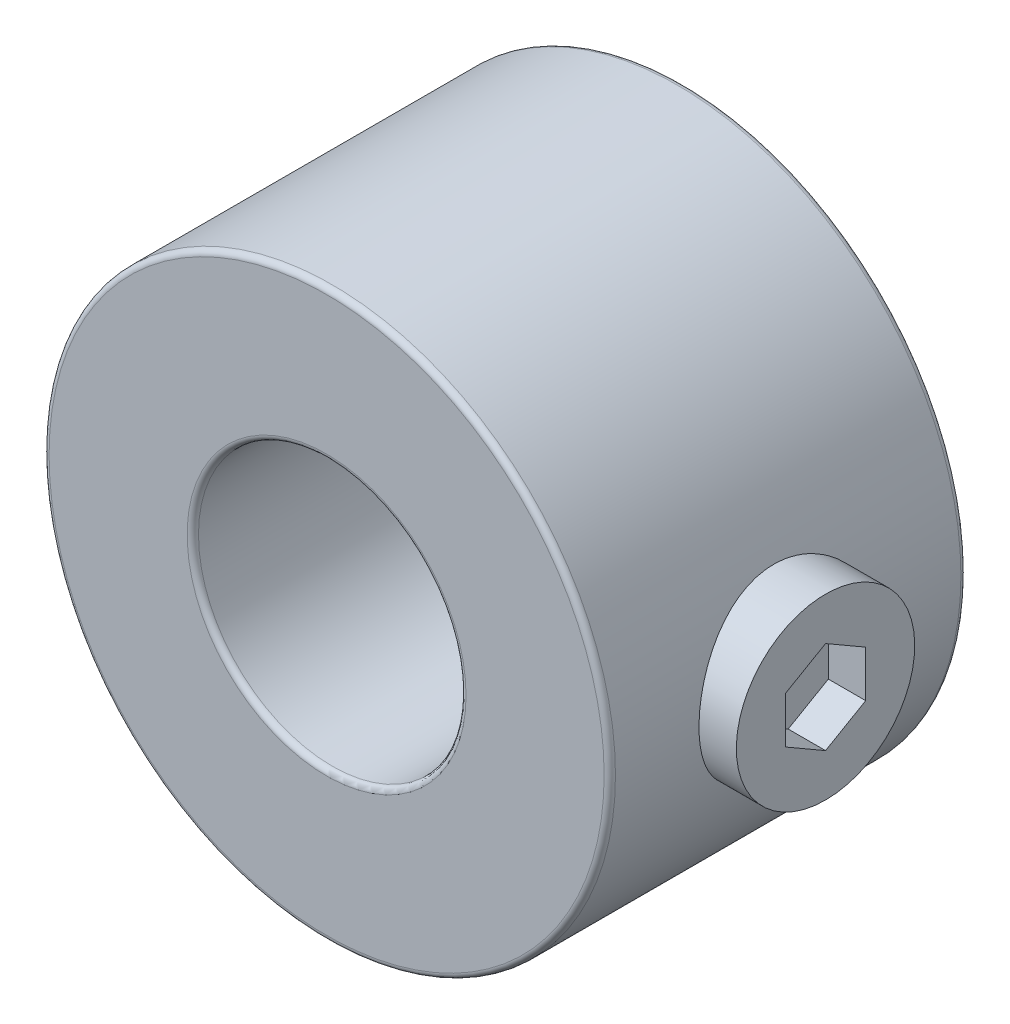
ISO-10303-21;
HEADER;
FILE_DESCRIPTION(('STEP AP214'),'2;1');
FILE_NAME('part.step','',(''),(''),'','','');
FILE_SCHEMA(('AUTOMOTIVE_DESIGN { 1 0 10303 214 1 1 1 1 }'));
ENDSEC;
DATA;
#1=APPLICATION_CONTEXT('core data for automotive mechanical design processes');
#2=APPLICATION_PROTOCOL_DEFINITION('international standard','automotive_design',2000,#1);
#3=PRODUCT_CONTEXT('',#1,'mechanical');
#4=PRODUCT('Part','Part','',(#3));
#5=PRODUCT_RELATED_PRODUCT_CATEGORY('part','',(#4));
#6=PRODUCT_DEFINITION_FORMATION('','',#4);
#7=PRODUCT_DEFINITION_CONTEXT('part definition',#1,'design');
#8=PRODUCT_DEFINITION('design','',#6,#7);
#9=PRODUCT_DEFINITION_SHAPE('','',#8);
#10=(LENGTH_UNIT() NAMED_UNIT(*) SI_UNIT(.MILLI.,.METRE.));
#11=(NAMED_UNIT(*) PLANE_ANGLE_UNIT() SI_UNIT($,.RADIAN.));
#12=(NAMED_UNIT(*) SI_UNIT($,.STERADIAN.) SOLID_ANGLE_UNIT());
#13=UNCERTAINTY_MEASURE_WITH_UNIT(LENGTH_MEASURE(1.E-05),#10,'distance_accuracy_value','');
#14=(GEOMETRIC_REPRESENTATION_CONTEXT(3) GLOBAL_UNCERTAINTY_ASSIGNED_CONTEXT((#13)) GLOBAL_UNIT_ASSIGNED_CONTEXT((#10,
#11,#12)) REPRESENTATION_CONTEXT('',''));
#15=CARTESIAN_POINT('',(0.,0.,0.));
#16=DIRECTION('',(0.,0.,1.));
#17=DIRECTION('',(1.,0.,0.));
#18=AXIS2_PLACEMENT_3D('',#15,#16,#17);
#19=CARTESIAN_POINT('',(3.8375,0.,4.));
#20=DIRECTION('',(1.,0.,0.));
#21=DIRECTION('',(0.,1.,0.));
#22=AXIS2_PLACEMENT_3D('',#19,#20,#21);
#23=PLANE('',#22);
#24=CARTESIAN_POINT('',(3.8375,0.,4.));
#25=DIRECTION('',(-1.,0.,0.));
#26=DIRECTION('',(0.,-1.,0.));
#27=AXIS2_PLACEMENT_3D('',#24,#25,#26);
#28=CIRCLE('',#27,2.);
#29=CARTESIAN_POINT('',(3.8375,-2.,4.));
#30=VERTEX_POINT('',#29);
#31=EDGE_CURVE('E12',#30,#30,#28,.T.);
#32=ORIENTED_EDGE('',*,*,#31,.T.);
#33=EDGE_LOOP('',(#32));
#34=FACE_BOUND('',#33,.T.);
#35=ADVANCED_FACE('F41',(#34),#23,.F.);
#36=CARTESIAN_POINT('',(3.8375,0.,4.));
#37=DIRECTION('',(-1.,0.,0.));
#38=DIRECTION('',(0.,-1.,0.));
#39=AXIS2_PLACEMENT_3D('',#36,#37,#38);
#40=CYLINDRICAL_SURFACE('',#39,2.);
#41=ORIENTED_EDGE('',*,*,#31,.F.);
#42=EDGE_LOOP('',(#41));
#43=FACE_BOUND('',#42,.T.);
#44=CARTESIAN_POINT('',(7.1875,0.,4.));
#45=DIRECTION('',(-1.,0.,0.));
#46=DIRECTION('',(0.,-1.,0.));
#47=AXIS2_PLACEMENT_3D('',#44,#45,#46);
#48=CIRCLE('',#47,2.);
#49=CARTESIAN_POINT('',(7.1875,-2.,4.));
#50=VERTEX_POINT('',#49);
#51=EDGE_CURVE('E48',#50,#50,#48,.T.);
#52=ORIENTED_EDGE('',*,*,#51,.T.);
#53=EDGE_LOOP('',(#52));
#54=FACE_BOUND('',#53,.T.);
#55=ADVANCED_FACE('F151',(#43,#54),#40,.T.);
#56=CARTESIAN_POINT('',(7.1875,0.,4.));
#57=DIRECTION('',(-1.,0.,0.));
#58=DIRECTION('',(0.,-1.,0.));
#59=AXIS2_PLACEMENT_3D('',#56,#57,#58);
#60=PLANE('',#59);
#61=DIRECTION('',(0.,-0.5,0.866025403784438));
#62=VECTOR('',#61,1.);
#63=CARTESIAN_POINT('',(7.1875,1.03923048454133,4.));
#64=LINE('',#63,#62);
#65=CARTESIAN_POINT('',(7.1875,1.03923048454133,4.));
#66=VERTEX_POINT('',#65);
#67=CARTESIAN_POINT('',(7.1875,0.51961524227067,4.9));
#68=VERTEX_POINT('',#67);
#69=EDGE_CURVE('E109',#66,#68,#64,.T.);
#70=ORIENTED_EDGE('',*,*,#69,.F.);
#71=DIRECTION('',(0.,0.5,0.866025403784439));
#72=VECTOR('',#71,1.);
#73=CARTESIAN_POINT('',(7.1875,0.519615242270671,3.1));
#74=LINE('',#73,#72);
#75=CARTESIAN_POINT('',(7.1875,0.519615242270671,3.1));
#76=VERTEX_POINT('',#75);
#77=EDGE_CURVE('E55',#76,#66,#74,.T.);
#78=ORIENTED_EDGE('',*,*,#77,.F.);
#79=DIRECTION('',(0.,1.,0.));
#80=VECTOR('',#79,1.);
#81=CARTESIAN_POINT('',(7.1875,-0.519615242270659,3.1));
#82=LINE('',#81,#80);
#83=CARTESIAN_POINT('',(7.1875,-0.519615242270659,3.1));
#84=VERTEX_POINT('',#83);
#85=EDGE_CURVE('E125',#84,#76,#82,.T.);
#86=ORIENTED_EDGE('',*,*,#85,.F.);
#87=DIRECTION('',(0.,0.5,-0.866025403784439));
#88=VECTOR('',#87,1.);
#89=CARTESIAN_POINT('',(7.1875,-1.03923048454132,4.));
#90=LINE('',#89,#88);
#91=CARTESIAN_POINT('',(7.1875,-1.03923048454132,4.));
#92=VERTEX_POINT('',#91);
#93=EDGE_CURVE('E119',#92,#84,#90,.T.);
#94=ORIENTED_EDGE('',*,*,#93,.F.);
#95=DIRECTION('',(0.,-0.5,-0.866025403784438));
#96=VECTOR('',#95,1.);
#97=CARTESIAN_POINT('',(7.1875,-0.519615242270657,4.9));
#98=LINE('',#97,#96);
#99=CARTESIAN_POINT('',(7.1875,-0.519615242270657,4.9));
#100=VERTEX_POINT('',#99);
#101=EDGE_CURVE('E117',#100,#92,#98,.T.);
#102=ORIENTED_EDGE('',*,*,#101,.F.);
#103=DIRECTION('',(0.,-1.,0.));
#104=VECTOR('',#103,1.);
#105=CARTESIAN_POINT('',(7.1875,0.51961524227067,4.9));
#106=LINE('',#105,#104);
#107=EDGE_CURVE('E98',#68,#100,#106,.T.);
#108=ORIENTED_EDGE('',*,*,#107,.F.);
#109=EDGE_LOOP('',(#70,#78,#86,#94,#102,#108));
#110=FACE_BOUND('',#109,.T.);
#111=ORIENTED_EDGE('',*,*,#51,.F.);
#112=EDGE_LOOP('',(#111));
#113=FACE_BOUND('',#112,.T.);
#114=ADVANCED_FACE('F113',(#110,#113),#60,.F.);
#115=CARTESIAN_POINT('',(6.35,0.519615242270671,3.1));
#116=DIRECTION('',(0.,0.866025403784439,-0.5));
#117=DIRECTION('',(0.,0.5,0.866025403784439));
#118=AXIS2_PLACEMENT_3D('',#115,#116,#117);
#119=PLANE('',#118);
#120=ORIENTED_EDGE('',*,*,#77,.T.);
#121=DIRECTION('',(1.,0.,0.));
#122=VECTOR('',#121,1.);
#123=CARTESIAN_POINT('',(6.35,1.03923048454133,4.));
#124=LINE('',#123,#122);
#125=CARTESIAN_POINT('',(6.35,1.03923048454133,4.));
#126=VERTEX_POINT('',#125);
#127=EDGE_CURVE('E106',#126,#66,#124,.T.);
#128=ORIENTED_EDGE('',*,*,#127,.F.);
#129=DIRECTION('',(0.,0.5,0.866025403784439));
#130=VECTOR('',#129,1.);
#131=CARTESIAN_POINT('',(6.35,0.519615242270671,3.1));
#132=LINE('',#131,#130);
#133=CARTESIAN_POINT('',(6.35,0.519615242270671,3.1));
#134=VERTEX_POINT('',#133);
#135=EDGE_CURVE('E127',#134,#126,#132,.T.);
#136=ORIENTED_EDGE('',*,*,#135,.F.);
#137=DIRECTION('',(1.,0.,0.));
#138=VECTOR('',#137,1.);
#139=CARTESIAN_POINT('',(6.35,0.519615242270671,3.1));
#140=LINE('',#139,#138);
#141=EDGE_CURVE('E62',#134,#76,#140,.T.);
#142=ORIENTED_EDGE('',*,*,#141,.T.);
#143=EDGE_LOOP('',(#120,#128,#136,#142));
#144=FACE_BOUND('',#143,.T.);
#145=ADVANCED_FACE('F153',(#144),#119,.F.);
#146=CARTESIAN_POINT('',(6.35,-0.519615242270659,3.1));
#147=DIRECTION('',(0.,0.,-1.));
#148=DIRECTION('',(-1.,0.,0.));
#149=AXIS2_PLACEMENT_3D('',#146,#147,#148);
#150=PLANE('',#149);
#151=ORIENTED_EDGE('',*,*,#85,.T.);
#152=ORIENTED_EDGE('',*,*,#141,.F.);
#153=DIRECTION('',(0.,1.,0.));
#154=VECTOR('',#153,1.);
#155=CARTESIAN_POINT('',(6.35,-0.519615242270659,3.1));
#156=LINE('',#155,#154);
#157=CARTESIAN_POINT('',(6.35,-0.519615242270659,3.1));
#158=VERTEX_POINT('',#157);
#159=EDGE_CURVE('E139',#158,#134,#156,.T.);
#160=ORIENTED_EDGE('',*,*,#159,.F.);
#161=DIRECTION('',(1.,0.,0.));
#162=VECTOR('',#161,1.);
#163=CARTESIAN_POINT('',(6.35,-0.519615242270659,3.1));
#164=LINE('',#163,#162);
#165=EDGE_CURVE('E143',#158,#84,#164,.T.);
#166=ORIENTED_EDGE('',*,*,#165,.T.);
#167=EDGE_LOOP('',(#151,#152,#160,#166));
#168=FACE_BOUND('',#167,.T.);
#169=ADVANCED_FACE('F159',(#168),#150,.F.);
#170=CARTESIAN_POINT('',(6.35,-1.03923048454132,4.));
#171=DIRECTION('',(0.,-0.866025403784439,-0.5));
#172=DIRECTION('',(0.,0.5,-0.866025403784439));
#173=AXIS2_PLACEMENT_3D('',#170,#171,#172);
#174=PLANE('',#173);
#175=ORIENTED_EDGE('',*,*,#93,.T.);
#176=ORIENTED_EDGE('',*,*,#165,.F.);
#177=DIRECTION('',(0.,0.5,-0.866025403784439));
#178=VECTOR('',#177,1.);
#179=CARTESIAN_POINT('',(6.35,-1.03923048454132,4.));
#180=LINE('',#179,#178);
#181=CARTESIAN_POINT('',(6.35,-1.03923048454132,4.));
#182=VERTEX_POINT('',#181);
#183=EDGE_CURVE('E136',#182,#158,#180,.T.);
#184=ORIENTED_EDGE('',*,*,#183,.F.);
#185=DIRECTION('',(1.,0.,0.));
#186=VECTOR('',#185,1.);
#187=CARTESIAN_POINT('',(6.35,-1.03923048454132,4.));
#188=LINE('',#187,#186);
#189=EDGE_CURVE('E145',#182,#92,#188,.T.);
#190=ORIENTED_EDGE('',*,*,#189,.T.);
#191=EDGE_LOOP('',(#175,#176,#184,#190));
#192=FACE_BOUND('',#191,.T.);
#193=ADVANCED_FACE('F190',(#192),#174,.F.);
#194=CARTESIAN_POINT('',(6.35,-0.519615242270657,4.9));
#195=DIRECTION('',(0.,-0.866025403784439,0.5));
#196=DIRECTION('',(0.,-0.5,-0.866025403784439));
#197=AXIS2_PLACEMENT_3D('',#194,#195,#196);
#198=PLANE('',#197);
#199=ORIENTED_EDGE('',*,*,#101,.T.);
#200=ORIENTED_EDGE('',*,*,#189,.F.);
#201=DIRECTION('',(0.,-0.5,-0.866025403784438));
#202=VECTOR('',#201,1.);
#203=CARTESIAN_POINT('',(6.35,-0.519615242270657,4.9));
#204=LINE('',#203,#202);
#205=CARTESIAN_POINT('',(6.35,-0.519615242270657,4.9));
#206=VERTEX_POINT('',#205);
#207=EDGE_CURVE('E133',#206,#182,#204,.T.);
#208=ORIENTED_EDGE('',*,*,#207,.F.);
#209=DIRECTION('',(1.,0.,0.));
#210=VECTOR('',#209,1.);
#211=CARTESIAN_POINT('',(6.35,-0.519615242270657,4.9));
#212=LINE('',#211,#210);
#213=EDGE_CURVE('E105',#206,#100,#212,.T.);
#214=ORIENTED_EDGE('',*,*,#213,.T.);
#215=EDGE_LOOP('',(#199,#200,#208,#214));
#216=FACE_BOUND('',#215,.T.);
#217=ADVANCED_FACE('F199',(#216),#198,.F.);
#218=CARTESIAN_POINT('',(6.35,0.51961524227067,4.9));
#219=DIRECTION('',(0.,0.,1.));
#220=DIRECTION('',(1.,0.,0.));
#221=AXIS2_PLACEMENT_3D('',#218,#219,#220);
#222=PLANE('',#221);
#223=ORIENTED_EDGE('',*,*,#107,.T.);
#224=ORIENTED_EDGE('',*,*,#213,.F.);
#225=DIRECTION('',(0.,-1.,0.));
#226=VECTOR('',#225,1.);
#227=CARTESIAN_POINT('',(6.35,0.51961524227067,4.9));
#228=LINE('',#227,#226);
#229=CARTESIAN_POINT('',(6.35,0.51961524227067,4.9));
#230=VERTEX_POINT('',#229);
#231=EDGE_CURVE('E101',#230,#206,#228,.T.);
#232=ORIENTED_EDGE('',*,*,#231,.F.);
#233=DIRECTION('',(1.,0.,0.));
#234=VECTOR('',#233,1.);
#235=CARTESIAN_POINT('',(6.35,0.51961524227067,4.9));
#236=LINE('',#235,#234);
#237=EDGE_CURVE('E94',#230,#68,#236,.T.);
#238=ORIENTED_EDGE('',*,*,#237,.T.);
#239=EDGE_LOOP('',(#223,#224,#232,#238));
#240=FACE_BOUND('',#239,.T.);
#241=ADVANCED_FACE('F96',(#240),#222,.F.);
#242=CARTESIAN_POINT('',(6.35,1.03923048454133,4.));
#243=DIRECTION('',(0.,0.866025403784438,0.5));
#244=DIRECTION('',(0.,-0.5,0.866025403784438));
#245=AXIS2_PLACEMENT_3D('',#242,#243,#244);
#246=PLANE('',#245);
#247=ORIENTED_EDGE('',*,*,#69,.T.);
#248=ORIENTED_EDGE('',*,*,#237,.F.);
#249=DIRECTION('',(0.,-0.5,0.866025403784438));
#250=VECTOR('',#249,1.);
#251=CARTESIAN_POINT('',(6.35,1.03923048454133,4.));
#252=LINE('',#251,#250);
#253=EDGE_CURVE('E130',#126,#230,#252,.T.);
#254=ORIENTED_EDGE('',*,*,#253,.F.);
#255=ORIENTED_EDGE('',*,*,#127,.T.);
#256=EDGE_LOOP('',(#247,#248,#254,#255));
#257=FACE_BOUND('',#256,.T.);
#258=ADVANCED_FACE('F110',(#257),#246,.F.);
#259=CARTESIAN_POINT('',(6.35,1.03923048454133,4.));
#260=DIRECTION('',(1.,0.,0.));
#261=DIRECTION('',(0.,0.,-1.));
#262=AXIS2_PLACEMENT_3D('',#259,#260,#261);
#263=PLANE('',#262);
#264=ORIENTED_EDGE('',*,*,#135,.T.);
#265=ORIENTED_EDGE('',*,*,#253,.T.);
#266=ORIENTED_EDGE('',*,*,#231,.T.);
#267=ORIENTED_EDGE('',*,*,#207,.T.);
#268=ORIENTED_EDGE('',*,*,#183,.T.);
#269=ORIENTED_EDGE('',*,*,#159,.T.);
#270=EDGE_LOOP('',(#264,#265,#266,#267,#268,#269));
#271=FACE_BOUND('',#270,.T.);
#272=ADVANCED_FACE('F226',(#271),#263,.T.);
#273=CLOSED_SHELL('',(#35,#55,#114,#145,#169,#193,#217,#241,#258,#272));
#274=MANIFOLD_SOLID_BREP('B2',#273);
#275=CARTESIAN_POINT('',(0.,0.,8.));
#276=DIRECTION('',(0.,0.,1.));
#277=DIRECTION('',(1.,0.,0.));
#278=AXIS2_PLACEMENT_3D('',#275,#276,#277);
#279=PLANE('',#278);
#280=CARTESIAN_POINT('',(0.,0.,8.));
#281=DIRECTION('',(0.,0.,1.));
#282=DIRECTION('',(1.,0.,0.));
#283=AXIS2_PLACEMENT_3D('',#280,#281,#282);
#284=CIRCLE('',#283,3.127);
#285=CARTESIAN_POINT('',(3.127,0.,8.));
#286=VERTEX_POINT('',#285);
#287=EDGE_CURVE('E259',#286,#286,#284,.F.);
#288=ORIENTED_EDGE('',*,*,#287,.T.);
#289=EDGE_LOOP('',(#288));
#290=FACE_BOUND('',#289,.T.);
#291=CARTESIAN_POINT('',(0.,0.,8.));
#292=DIRECTION('',(0.,0.,1.));
#293=DIRECTION('',(1.,0.,0.));
#294=AXIS2_PLACEMENT_3D('',#291,#292,#293);
#295=CIRCLE('',#294,6.223);
#296=CARTESIAN_POINT('',(6.223,0.,8.));
#297=VERTEX_POINT('',#296);
#298=EDGE_CURVE('E263',#297,#297,#295,.T.);
#299=ORIENTED_EDGE('',*,*,#298,.T.);
#300=EDGE_LOOP('',(#299));
#301=FACE_BOUND('',#300,.T.);
#302=ADVANCED_FACE('F247',(#290,#301),#279,.T.);
#303=CARTESIAN_POINT('',(0.,0.,0.));
#304=DIRECTION('',(0.,0.,1.));
#305=DIRECTION('',(1.,0.,0.));
#306=AXIS2_PLACEMENT_3D('',#303,#304,#305);
#307=PLANE('',#306);
#308=CARTESIAN_POINT('',(0.,0.,0.));
#309=DIRECTION('',(0.,0.,1.));
#310=DIRECTION('',(1.,0.,0.));
#311=AXIS2_PLACEMENT_3D('',#308,#309,#310);
#312=CIRCLE('',#311,3.127);
#313=CARTESIAN_POINT('',(3.127,0.,0.));
#314=VERTEX_POINT('',#313);
#315=EDGE_CURVE('E274',#314,#314,#312,.T.);
#316=ORIENTED_EDGE('',*,*,#315,.T.);
#317=EDGE_LOOP('',(#316));
#318=FACE_BOUND('',#317,.T.);
#319=CARTESIAN_POINT('',(0.,0.,0.));
#320=DIRECTION('',(0.,0.,1.));
#321=DIRECTION('',(1.,0.,0.));
#322=AXIS2_PLACEMENT_3D('',#319,#320,#321);
#323=CIRCLE('',#322,6.223);
#324=CARTESIAN_POINT('',(6.223,0.,0.));
#325=VERTEX_POINT('',#324);
#326=EDGE_CURVE('E277',#325,#325,#323,.F.);
#327=ORIENTED_EDGE('',*,*,#326,.T.);
#328=EDGE_LOOP('',(#327));
#329=FACE_BOUND('',#328,.T.);
#330=ADVANCED_FACE('F318',(#318,#329),#307,.F.);
#331=CARTESIAN_POINT('',(0.,0.,8.));
#332=DIRECTION('',(0.,0.,-1.));
#333=DIRECTION('',(-1.,0.,0.));
#334=AXIS2_PLACEMENT_3D('',#331,#332,#333);
#335=CYLINDRICAL_SURFACE('',#334,6.35);
#336=CARTESIAN_POINT('',(0.,0.,0.127));
#337=DIRECTION('',(0.,0.,1.));
#338=DIRECTION('',(1.,0.,0.));
#339=AXIS2_PLACEMENT_3D('',#336,#337,#338);
#340=CIRCLE('',#339,6.35);
#341=CARTESIAN_POINT('',(6.35,0.,0.127));
#342=VERTEX_POINT('',#341);
#343=EDGE_CURVE('E40',#342,#342,#340,.T.);
#344=ORIENTED_EDGE('',*,*,#343,.T.);
#345=EDGE_LOOP('',(#344));
#346=FACE_BOUND('',#345,.T.);
#347=CARTESIAN_POINT('',(0.,0.,7.873));
#348=DIRECTION('',(0.,0.,1.));
#349=DIRECTION('',(1.,0.,0.));
#350=AXIS2_PLACEMENT_3D('',#347,#348,#349);
#351=CIRCLE('',#350,6.35);
#352=CARTESIAN_POINT('',(6.35,0.,7.873));
#353=VERTEX_POINT('',#352);
#354=EDGE_CURVE('E255',#353,#353,#351,.F.);
#355=ORIENTED_EDGE('',*,*,#354,.T.);
#356=EDGE_LOOP('',(#355));
#357=FACE_BOUND('',#356,.T.);
#358=CARTESIAN_POINT('',(6.35,0.,2.));
#359=CARTESIAN_POINT('',(6.34999954177388,-0.109459382542907,2.00000058354949));
#360=CARTESIAN_POINT('',(6.34714311321166,-0.218925049959982,2.00901558710158));
#361=CARTESIAN_POINT('',(6.33602827356407,-0.434652473788955,2.0447410824913));
#362=CARTESIAN_POINT('',(6.32776871709148,-0.540913545874182,2.07145532633458));
#363=CARTESIAN_POINT('',(6.30674936557198,-0.747089875657803,2.14158716072899));
#364=CARTESIAN_POINT('',(6.2939966038065,-0.847014764673544,2.1849786557192));
#365=CARTESIAN_POINT('',(6.26530583445687,-1.03817017833074,2.287121440277));
#366=CARTESIAN_POINT('',(6.24936730983397,-1.12939928812193,2.34587522357063));
#367=CARTESIAN_POINT('',(6.21543683798116,-1.30343118018697,2.47901136120565));
#368=CARTESIAN_POINT('',(6.19739963027479,-1.38592345094522,2.55378802635612));
#369=CARTESIAN_POINT('',(6.16156531174633,-1.53742831833673,2.71600787243298));
#370=CARTESIAN_POINT('',(6.14376824711775,-1.60643835501439,2.80345345340626));
#371=CARTESIAN_POINT('',(6.10994220236164,-1.73071363408787,2.99122929376167));
#372=CARTESIAN_POINT('',(6.09396900491067,-1.78558916761595,3.09182847722825));
#373=CARTESIAN_POINT('',(6.06628083683232,-1.87751386092633,3.30141198660405));
#374=CARTESIAN_POINT('',(6.05456472452069,-1.91456780104787,3.41039405483927));
#375=CARTESIAN_POINT('',(6.03719105635797,-1.96865797245166,3.63014256754477));
#376=CARTESIAN_POINT('',(6.03135942687504,-1.98627089440143,3.74075291341509));
#377=CARTESIAN_POINT('',(6.02589838737815,-2.00278087222624,3.96350056160201));
#378=CARTESIAN_POINT('',(6.02626729850522,-2.00168299423813,4.0756374423777));
#379=CARTESIAN_POINT('',(6.03301213155008,-1.98125320609646,4.29346796254297));
#380=CARTESIAN_POINT('',(6.03914580837347,-1.96265658538293,4.39923933126119));
#381=CARTESIAN_POINT('',(6.05633519979144,-1.90895021373769,4.60607693428555));
#382=CARTESIAN_POINT('',(6.06739144503234,-1.8738386824976,4.7071426600319));
#383=CARTESIAN_POINT('',(6.09336435153691,-1.78758434079555,4.90344233081236));
#384=CARTESIAN_POINT('',(6.10833567795451,-1.73621215869284,4.99856794601275));
#385=CARTESIAN_POINT('',(6.14042705773518,-1.6190540664784,5.17908872150141));
#386=CARTESIAN_POINT('',(6.15754767614424,-1.55326436261562,5.26448131168549));
#387=CARTESIAN_POINT('',(6.19297824394465,-1.40553948054554,5.42726612322606));
#388=CARTESIAN_POINT('',(6.21130656429871,-1.32299795804768,5.5041051229237));
#389=CARTESIAN_POINT('',(6.24638917019528,-1.14597287727256,5.64298607600785));
#390=CARTESIAN_POINT('',(6.26314333535267,-1.05148840693984,5.70502689824582));
#391=CARTESIAN_POINT('',(6.29337063173254,-0.852181054275976,5.81293320937956));
#392=CARTESIAN_POINT('',(6.30681635072295,-0.747281283701515,5.85866488145912));
#393=CARTESIAN_POINT('',(6.32871380255594,-0.530755398571078,5.93166785389612));
#394=CARTESIAN_POINT('',(6.33716707666898,-0.419131371671137,5.9589448519701));
#395=CARTESIAN_POINT('',(6.34787832908592,-0.197020017835356,5.99331746782127));
#396=CARTESIAN_POINT('',(6.35036604099747,-0.0866594761204061,6.0011618491616));
#397=CARTESIAN_POINT('',(6.34954641773508,0.133813926362039,5.99856019855348));
#398=CARTESIAN_POINT('',(6.34623994398885,0.243926821510503,5.98811688545606));
#399=CARTESIAN_POINT('',(6.33435451969436,0.457878637788791,5.94983646146118));
#400=CARTESIAN_POINT('',(6.325911202165,0.561805824109794,5.92244650327112));
#401=CARTESIAN_POINT('',(6.30474229444981,0.763559126456238,5.85159744836663));
#402=CARTESIAN_POINT('',(6.29201617296049,0.861384483733321,5.80813635788091));
#403=CARTESIAN_POINT('',(6.26319856305455,1.05083641206033,5.70518375229588));
#404=CARTESIAN_POINT('',(6.24703194034034,1.14225110153446,5.64532394819846));
#405=CARTESIAN_POINT('',(6.21318025142312,1.31398832981217,5.51171388169452));
#406=CARTESIAN_POINT('',(6.19549476796847,1.394307804701,5.43795979565597));
#407=CARTESIAN_POINT('',(6.15970098041184,1.54493496266177,5.27513269683127));
#408=CARTESIAN_POINT('',(6.1416043516294,1.61470885314467,5.18556218774911));
#409=CARTESIAN_POINT('',(6.10778048462925,1.73828550034023,4.99559091681831));
#410=CARTESIAN_POINT('',(6.09205321442616,1.79208847266324,4.89519030120304));
#411=CARTESIAN_POINT('',(6.06492137157674,1.88186972548412,4.68659077566598));
#412=CARTESIAN_POINT('',(6.05350088491069,1.91791378151849,4.57842236888354));
#413=CARTESIAN_POINT('',(6.03638058511952,1.97114343438127,4.35711703695491));
#414=CARTESIAN_POINT('',(6.03067855056365,1.98833635449891,4.24398205899937));
#415=CARTESIAN_POINT('',(6.02587471885277,2.00284439370545,4.02154245016702));
#416=CARTESIAN_POINT('',(6.02648176413455,2.00103634345504,3.91230059749889));
#417=CARTESIAN_POINT('',(6.03351893966243,1.97971522185172,3.69575938742112));
#418=CARTESIAN_POINT('',(6.0399487901614,1.96020300106662,3.58845993694455));
#419=CARTESIAN_POINT('',(6.05770205715241,1.90461841343822,3.3804445602737));
#420=CARTESIAN_POINT('',(6.06895005951139,1.86880073990096,3.27965365194179));
#421=CARTESIAN_POINT('',(6.0950519726527,1.78182311987174,3.08543184362183));
#422=CARTESIAN_POINT('',(6.10990662507357,1.7306600173762,2.99200246263139));
#423=CARTESIAN_POINT('',(6.14228296482453,1.61207166769779,2.81114466448104));
#424=CARTESIAN_POINT('',(6.15988705347009,1.54408200610561,2.724101128443));
#425=CARTESIAN_POINT('',(6.19540382399596,1.39475914789555,2.56237483925015));
#426=CARTESIAN_POINT('',(6.21331658777418,1.31342235965995,2.48769542408948));
#427=CARTESIAN_POINT('',(6.24814930497826,1.1364502290777,2.35032141081745));
#428=CARTESIAN_POINT('',(6.26501620684602,1.04042842012034,2.28810970882047));
#429=CARTESIAN_POINT('',(6.29518499838427,0.8387590923247,2.1807921190618));
#430=CARTESIAN_POINT('',(6.30848823421977,0.733115228456039,2.13567976938718));
#431=CARTESIAN_POINT('',(6.32915110555605,0.523924084589955,2.06696118897334));
#432=CARTESIAN_POINT('',(6.33690087757197,0.420884380962411,2.04192397723383));
#433=CARTESIAN_POINT('',(6.34732501355995,0.211898004201454,2.00844484312058));
#434=CARTESIAN_POINT('',(6.35000044354306,0.105951946376476,1.99999943514934));
#435=CARTESIAN_POINT('',(6.35,0.,2.));
#436=B_SPLINE_CURVE_WITH_KNOTS('',3,(#358,#359,#360,#361,#362,#363,#364,#365,#366,#367,#368,
#369,#370,#371,#372,#373,#374,#375,#376,#377,#378,#379,#380,#381,#382,#383,#384,#385,#386,#387,
#388,#389,#390,#391,#392,#393,#394,#395,#396,#397,#398,#399,#400,#401,#402,#403,#404,#405,#406,
#407,#408,#409,#410,#411,#412,#413,#414,#415,#416,#417,#418,#419,#420,#421,#422,#423,#424,#425,
#426,#427,#428,#429,#430,#431,#432,#433,#434,#435),.UNSPECIFIED.,.T.,.F.,(4,2,2,2,2,2,2,2,2,2,2,
2,2,2,2,2,2,2,2,2,2,2,2,2,2,2,2,2,2,2,2,2,2,2,2,2,2,2,4),(0.,0.327988650558007,
0.656046852642941,0.983593805173076,1.31119396071542,1.6480406473964,1.98495123122211,
2.33034249119075,2.67564105409013,3.01039595432063,3.34506021774285,3.66626171481526,
3.98749784536771,4.31348397544876,4.63955598702786,4.9807199943601,5.32191007136131,
5.66583848283943,6.00966066096294,6.34001323425943,6.67031669785623,6.99225602053112,
7.31423529613717,7.64414085870835,7.97413734250024,8.31743010871832,8.6607182402099,
9.00272515843012,9.34459916667784,9.67076879349641,9.99692275086077,10.3181482438305,
10.6394398466999,10.9734721104888,11.3075944078494,11.6528624869261,11.9979999574323,
12.3155454971876,12.6330243200048),.UNSPECIFIED.);
#437=CARTESIAN_POINT('',(6.35,0.,2.));
#438=VERTEX_POINT('',#437);
#439=EDGE_CURVE('E280',#438,#438,#436,.T.);
#440=ORIENTED_EDGE('',*,*,#439,.T.);
#441=EDGE_LOOP('',(#440));
#442=FACE_BOUND('',#441,.T.);
#443=ADVANCED_FACE('F249',(#346,#357,#442),#335,.T.);
#444=CARTESIAN_POINT('',(0.,0.,8.));
#445=DIRECTION('',(0.,0.,-1.));
#446=DIRECTION('',(-1.,0.,0.));
#447=AXIS2_PLACEMENT_3D('',#444,#445,#446);
#448=CYLINDRICAL_SURFACE('',#447,3.);
#449=CARTESIAN_POINT('',(0.,0.,0.127));
#450=DIRECTION('',(0.,0.,1.));
#451=DIRECTION('',(1.,0.,0.));
#452=AXIS2_PLACEMENT_3D('',#449,#450,#451);
#453=CIRCLE('',#452,3.);
#454=CARTESIAN_POINT('',(3.,0.,0.127));
#455=VERTEX_POINT('',#454);
#456=EDGE_CURVE('E268',#455,#455,#453,.F.);
#457=ORIENTED_EDGE('',*,*,#456,.T.);
#458=EDGE_LOOP('',(#457));
#459=FACE_BOUND('',#458,.T.);
#460=CARTESIAN_POINT('',(0.,0.,7.873));
#461=DIRECTION('',(0.,0.,1.));
#462=DIRECTION('',(1.,0.,0.));
#463=AXIS2_PLACEMENT_3D('',#460,#461,#462);
#464=CIRCLE('',#463,3.);
#465=CARTESIAN_POINT('',(3.,0.,7.873));
#466=VERTEX_POINT('',#465);
#467=EDGE_CURVE('E271',#466,#466,#464,.T.);
#468=ORIENTED_EDGE('',*,*,#467,.T.);
#469=EDGE_LOOP('',(#468));
#470=FACE_BOUND('',#469,.T.);
#471=CARTESIAN_POINT('',(3.,0.,2.));
#472=CARTESIAN_POINT('',(3.0000004164484,-0.100484716668078,1.99999945036753));
#473=CARTESIAN_POINT('',(2.99490802753388,-0.200969087132901,2.0076139699555));
#474=CARTESIAN_POINT('',(2.97504652423808,-0.398733058031681,2.03759686410566));
#475=CARTESIAN_POINT('',(2.96027281581235,-0.496011113955006,2.05997224312329));
#476=CARTESIAN_POINT('',(2.92250482404708,-0.684212307854249,2.11810771732484));
#477=CARTESIAN_POINT('',(2.89954905493315,-0.775162872657554,2.15380514000794));
#478=CARTESIAN_POINT('',(2.8472613787744,-0.94941529099726,2.2370633632715));
#479=CARTESIAN_POINT('',(2.8179285460551,-1.03271603160967,2.28462588630056));
#480=CARTESIAN_POINT('',(2.75227329369838,-1.19728470077011,2.39465693736743));
#481=CARTESIAN_POINT('',(2.71556897579319,-1.27778030546067,2.45804786074289));
#482=CARTESIAN_POINT('',(2.63982313083466,-1.42772804469274,2.59573004865845));
#483=CARTESIAN_POINT('',(2.60077830356832,-1.49716405543888,2.67003692983774));
#484=CARTESIAN_POINT('',(2.51728264678794,-1.63422297745496,2.84105236761267));
#485=CARTESIAN_POINT('',(2.47295067937795,-1.6998318636275,2.93944565320345));
#486=CARTESIAN_POINT('',(2.3908414735282,-1.81350357014175,3.14836337764653));
#487=CARTESIAN_POINT('',(2.35305295954667,-1.86159673426503,3.25886640156274));
#488=CARTESIAN_POINT('',(2.2997626664146,-1.92674035011438,3.45671129342162));
#489=CARTESIAN_POINT('',(2.28097627892403,-1.94874447236008,3.54152845287391));
#490=CARTESIAN_POINT('',(2.25257969659604,-1.98150617785228,3.71474450474165));
#491=CARTESIAN_POINT('',(2.24295368744147,-1.99228314651963,3.80313694872606));
#492=CARTESIAN_POINT('',(2.23436605608045,-2.00191364141227,3.98147477885647));
#493=CARTESIAN_POINT('',(2.23544802558502,-2.00071842917524,4.0714250234524));
#494=CARTESIAN_POINT('',(2.24819775483425,-1.98637581333356,4.24963497349975));
#495=CARTESIAN_POINT('',(2.25987448286881,-1.97321828380393,4.33789318202813));
#496=CARTESIAN_POINT('',(2.29127185989959,-1.93664994217326,4.50646705124188));
#497=CARTESIAN_POINT('',(2.31061488324375,-1.91371711479477,4.58696133593877));
#498=CARTESIAN_POINT('',(2.35509622933623,-1.85870118583424,4.74302369097578));
#499=CARTESIAN_POINT('',(2.38023645854889,-1.82661507328551,4.81859013023865));
#500=CARTESIAN_POINT('',(2.43964196377947,-1.74673818732648,4.97902539535644));
#501=CARTESIAN_POINT('',(2.47472317740626,-1.69708052300445,5.06265990048309));
#502=CARTESIAN_POINT('',(2.54691537733438,-1.58668960438221,5.22138339528575));
#503=CARTESIAN_POINT('',(2.58402882709328,-1.52594268999614,5.29646165776207));
#504=CARTESIAN_POINT('',(2.66543343763724,-1.37981165322309,5.45254254560342));
#505=CARTESIAN_POINT('',(2.7095474472056,-1.29193938283656,5.53133404868276));
#506=CARTESIAN_POINT('',(2.79218100665211,-1.10200799908008,5.67319649453848));
#507=CARTESIAN_POINT('',(2.83070577648042,-0.999962299343699,5.73628214540898));
#508=CARTESIAN_POINT('',(2.89145404090364,-0.804857827096533,5.83347771862287));
#509=CARTESIAN_POINT('',(2.91539261165539,-0.713957643371913,5.87084336333894));
#510=CARTESIAN_POINT('',(2.95507719030498,-0.526036043935484,5.93210492562537));
#511=CARTESIAN_POINT('',(2.97083012127543,-0.429019879001653,5.95601222713221));
#512=CARTESIAN_POINT('',(2.99275882156808,-0.230985453172284,5.989161165238));
#513=CARTESIAN_POINT('',(2.99889322461186,-0.129951811934161,5.99833946093826));
#514=CARTESIAN_POINT('',(3.00083114965146,0.0724415193893436,6.00124708856221));
#515=CARTESIAN_POINT('',(2.99663539385634,0.173801186186622,5.99497750048877));
#516=CARTESIAN_POINT('',(2.97899589424273,0.366455717204236,5.96837594443805));
#517=CARTESIAN_POINT('',(2.96622246390226,0.457957444679191,5.94906270224478));
#518=CARTESIAN_POINT('',(2.93318449284837,0.636116392427398,5.89840431398714));
#519=CARTESIAN_POINT('',(2.91291875746989,0.722772837571131,5.86705724907179));
#520=CARTESIAN_POINT('',(2.86496352529158,0.894664750465994,5.79134770295508));
#521=CARTESIAN_POINT('',(2.83689870135785,0.979496184631417,5.74631184591815));
#522=CARTESIAN_POINT('',(2.77601855611511,1.14068302395729,5.64556671005373));
#523=CARTESIAN_POINT('',(2.74320030403941,1.21703314820091,5.58985083946783));
#524=CARTESIAN_POINT('',(2.6695454665343,1.37185445482324,5.45939213184249));
#525=CARTESIAN_POINT('',(2.62826156800165,1.44875187569565,5.38303373992492));
#526=CARTESIAN_POINT('',(2.54571173085958,1.58933968069449,5.21888857004289));
#527=CARTESIAN_POINT('',(2.50444582417845,1.6530209365723,5.1310939608925));
#528=CARTESIAN_POINT('',(2.4293967897058,1.76124776549313,4.95285758723188));
#529=CARTESIAN_POINT('',(2.39527597025701,1.80695636125283,4.86326796653779));
#530=CARTESIAN_POINT('',(2.33438974266154,1.88496213740264,4.67612734755637));
#531=CARTESIAN_POINT('',(2.30761112529822,1.91728345682189,4.57859106169538));
#532=CARTESIAN_POINT('',(2.26933208182632,1.9623584346534,4.39543551280459));
#533=CARTESIAN_POINT('',(2.25594998021257,1.97758597566225,4.31082819012399));
#534=CARTESIAN_POINT('',(2.23879466438398,1.99699205923373,4.13942671868162));
#535=CARTESIAN_POINT('',(2.23501101347816,2.00118260285317,4.05263504886051));
#536=CARTESIAN_POINT('',(2.23764201149981,1.99823921981266,3.87935694327631));
#537=CARTESIAN_POINT('',(2.24406269907463,1.99109858767784,3.79287071862625));
#538=CARTESIAN_POINT('',(2.26610452403491,1.96596997224746,3.62265647146789));
#539=CARTESIAN_POINT('',(2.28173793527615,1.94796751728258,3.53893228617568));
#540=CARTESIAN_POINT('',(2.325268439048,1.89593035657494,3.35428881351877));
#541=CARTESIAN_POINT('',(2.35532333574982,1.85890187130765,3.25473228705668));
#542=CARTESIAN_POINT('',(2.42222161121309,1.77084526236221,3.0645131656158));
#543=CARTESIAN_POINT('',(2.45907449686699,1.71979748341259,2.97386330200831));
#544=CARTESIAN_POINT('',(2.53617186577119,1.60398280555153,2.80071811286377));
#545=CARTESIAN_POINT('',(2.5764658739228,1.53898309894021,2.71840125457696));
#546=CARTESIAN_POINT('',(2.65628301537844,1.39671768031095,2.56467752174208));
#547=CARTESIAN_POINT('',(2.69580590832396,1.31944821025749,2.49327400297079));
#548=CARTESIAN_POINT('',(2.77631551964082,1.14145732976975,2.35328789569092));
#549=CARTESIAN_POINT('',(2.81669805449991,1.03896166955575,2.28658135982168));
#550=CARTESIAN_POINT('',(2.88777665874161,0.820868555771221,2.1720867233347));
#551=CARTESIAN_POINT('',(2.91848793445255,0.705292062449161,2.12426889317605));
#552=CARTESIAN_POINT('',(2.96101644836895,0.491435069835749,2.05884542183622));
#553=CARTESIAN_POINT('',(2.97551480368934,0.395012325257924,2.03688896090138));
#554=CARTESIAN_POINT('',(2.99500280141853,0.199058012023947,2.0074719674619));
#555=CARTESIAN_POINT('',(2.99999958751315,0.0995288361880083,2.00000054440399));
#556=CARTESIAN_POINT('',(3.,0.,2.));
#557=B_SPLINE_CURVE_WITH_KNOTS('',3,(#471,#472,#473,#474,#475,#476,#477,#478,#479,#480,#481,
#482,#483,#484,#485,#486,#487,#488,#489,#490,#491,#492,#493,#494,#495,#496,#497,#498,#499,#500,
#501,#502,#503,#504,#505,#506,#507,#508,#509,#510,#511,#512,#513,#514,#515,#516,#517,#518,#519,
#520,#521,#522,#523,#524,#525,#526,#527,#528,#529,#530,#531,#532,#533,#534,#535,#536,#537,#538,
#539,#540,#541,#542,#543,#544,#545,#546,#547,#548,#549,#550,#551,#552,#553,#554,#555,#556),
.UNSPECIFIED.,.T.,.F.,(4,2,2,2,2,2,2,2,2,2,2,2,2,2,2,2,2,2,2,2,2,2,2,2,2,2,2,2,2,2,2,2,2,2,2,2,
2,2,2,2,2,2,4),(0.,0.3010532265054,0.602249414348688,0.902046153190231,1.20188643867386,
1.52717029000557,1.85292411604318,2.23006683295982,2.60655305445439,2.87433693676029,
3.14165767845809,3.41006711735378,3.67870397263352,3.93548862198022,4.19235783805078,
4.50147574660873,4.81097703780057,5.18718954496752,5.56304840301362,5.86524087696758,
6.16717735142813,6.4704088329425,6.77361911533414,7.05553084792472,7.3374875513827,
7.63652346829516,7.93574454945204,8.28228176141291,8.62905753175757,8.94649935304476,
9.26336626640723,9.52324048016135,9.78283200333091,10.0425772028455,10.302669238524,
10.6320660870419,10.9619271337795,11.2977924520448,11.6337608397015,12.0179535155883,
12.4015390656083,12.6999529136674,12.9981423125957),.UNSPECIFIED.);
#558=CARTESIAN_POINT('',(3.,0.,2.));
#559=VERTEX_POINT('',#558);
#560=EDGE_CURVE('E281',#559,#559,#557,.T.);
#561=ORIENTED_EDGE('',*,*,#560,.F.);
#562=EDGE_LOOP('',(#561));
#563=FACE_BOUND('',#562,.T.);
#564=ADVANCED_FACE('F290',(#459,#470,#563),#448,.F.);
#565=CARTESIAN_POINT('',(-5.65685424949238,0.,4.));
#566=DIRECTION('',(1.,0.,0.));
#567=DIRECTION('',(0.,0.,-1.));
#568=AXIS2_PLACEMENT_3D('',#565,#566,#567);
#569=CYLINDRICAL_SURFACE('',#568,2.);
#570=ORIENTED_EDGE('',*,*,#560,.T.);
#571=EDGE_LOOP('',(#570));
#572=FACE_BOUND('',#571,.T.);
#573=ORIENTED_EDGE('',*,*,#439,.F.);
#574=EDGE_LOOP('',(#573));
#575=FACE_BOUND('',#574,.T.);
#576=ADVANCED_FACE('F293',(#572,#575),#569,.F.);
#577=CARTESIAN_POINT('',(0.,0.,0.127));
#578=DIRECTION('',(0.,0.,1.));
#579=DIRECTION('',(1.,0.,0.));
#580=AXIS2_PLACEMENT_3D('',#577,#578,#579);
#581=TOROIDAL_SURFACE('',#580,3.127,0.127);
#582=ORIENTED_EDGE('',*,*,#456,.F.);
#583=EDGE_LOOP('',(#582));
#584=FACE_BOUND('',#583,.T.);
#585=ORIENTED_EDGE('',*,*,#315,.F.);
#586=EDGE_LOOP('',(#585));
#587=FACE_BOUND('',#586,.T.);
#588=ADVANCED_FACE('F297',(#584,#587),#581,.T.);
#589=CARTESIAN_POINT('',(0.,0.,7.873));
#590=DIRECTION('',(0.,0.,1.));
#591=DIRECTION('',(1.,0.,0.));
#592=AXIS2_PLACEMENT_3D('',#589,#590,#591);
#593=TOROIDAL_SURFACE('',#592,3.127,0.127);
#594=ORIENTED_EDGE('',*,*,#287,.F.);
#595=EDGE_LOOP('',(#594));
#596=FACE_BOUND('',#595,.T.);
#597=ORIENTED_EDGE('',*,*,#467,.F.);
#598=EDGE_LOOP('',(#597));
#599=FACE_BOUND('',#598,.T.);
#600=ADVANCED_FACE('F302',(#596,#599),#593,.T.);
#601=CARTESIAN_POINT('',(0.,0.,0.127));
#602=DIRECTION('',(0.,0.,1.));
#603=DIRECTION('',(1.,0.,0.));
#604=AXIS2_PLACEMENT_3D('',#601,#602,#603);
#605=TOROIDAL_SURFACE('',#604,6.223,0.127);
#606=ORIENTED_EDGE('',*,*,#326,.F.);
#607=EDGE_LOOP('',(#606));
#608=FACE_BOUND('',#607,.T.);
#609=ORIENTED_EDGE('',*,*,#343,.F.);
#610=EDGE_LOOP('',(#609));
#611=FACE_BOUND('',#610,.T.);
#612=ADVANCED_FACE('F306',(#608,#611),#605,.T.);
#613=CARTESIAN_POINT('',(0.,0.,7.873));
#614=DIRECTION('',(0.,0.,1.));
#615=DIRECTION('',(1.,0.,0.));
#616=AXIS2_PLACEMENT_3D('',#613,#614,#615);
#617=TOROIDAL_SURFACE('',#616,6.223,0.127);
#618=ORIENTED_EDGE('',*,*,#354,.F.);
#619=EDGE_LOOP('',(#618));
#620=FACE_BOUND('',#619,.T.);
#621=ORIENTED_EDGE('',*,*,#298,.F.);
#622=EDGE_LOOP('',(#621));
#623=FACE_BOUND('',#622,.T.);
#624=ADVANCED_FACE('F310',(#620,#623),#617,.T.);
#625=CLOSED_SHELL('',(#302,#330,#443,#564,#576,#588,#600,#612,#624));
#626=MANIFOLD_SOLID_BREP('B6',#625);
#627=ADVANCED_BREP_SHAPE_REPRESENTATION('',(#18,#274,#626),#14);
#628=SHAPE_DEFINITION_REPRESENTATION(#9,#627);
ENDSEC;
END-ISO-10303-21;
